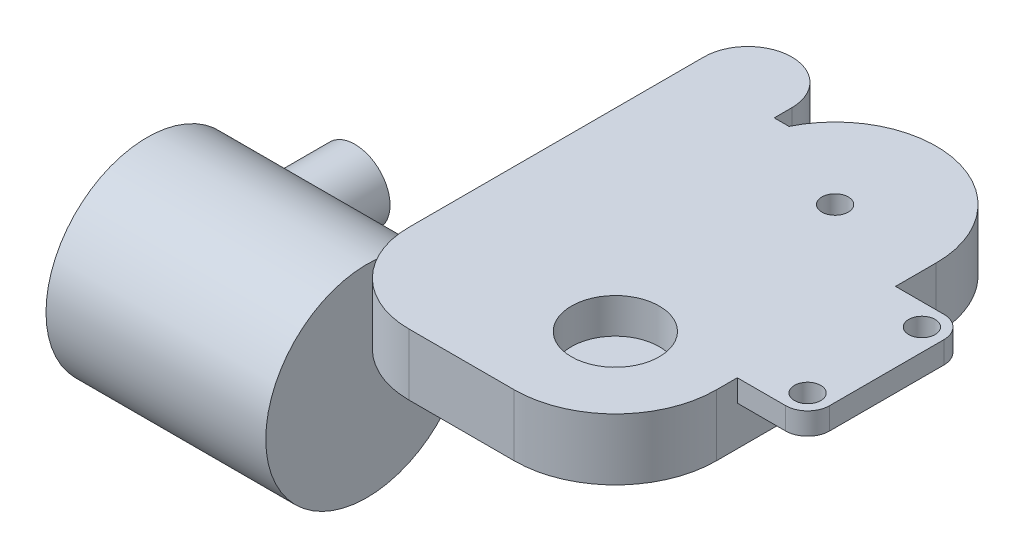
ISO-10303-21;
HEADER;
FILE_DESCRIPTION(('STEP AP214'),'2;1');
FILE_NAME('part.step','',(''),(''),'','','');
FILE_SCHEMA(('AUTOMOTIVE_DESIGN { 1 0 10303 214 1 1 1 1 }'));
ENDSEC;
DATA;
#1=APPLICATION_CONTEXT('core data for automotive mechanical design processes');
#2=APPLICATION_PROTOCOL_DEFINITION('international standard','automotive_design',2000,#1);
#3=PRODUCT_CONTEXT('',#1,'mechanical');
#4=PRODUCT('Part','Part','',(#3));
#5=PRODUCT_RELATED_PRODUCT_CATEGORY('part','',(#4));
#6=PRODUCT_DEFINITION_FORMATION('','',#4);
#7=PRODUCT_DEFINITION_CONTEXT('part definition',#1,'design');
#8=PRODUCT_DEFINITION('design','',#6,#7);
#9=PRODUCT_DEFINITION_SHAPE('','',#8);
#10=(LENGTH_UNIT() NAMED_UNIT(*) SI_UNIT(.MILLI.,.METRE.));
#11=(NAMED_UNIT(*) PLANE_ANGLE_UNIT() SI_UNIT($,.RADIAN.));
#12=(NAMED_UNIT(*) SI_UNIT($,.STERADIAN.) SOLID_ANGLE_UNIT());
#13=UNCERTAINTY_MEASURE_WITH_UNIT(LENGTH_MEASURE(1.E-05),#10,'distance_accuracy_value','');
#14=(GEOMETRIC_REPRESENTATION_CONTEXT(3) GLOBAL_UNCERTAINTY_ASSIGNED_CONTEXT((#13)) GLOBAL_UNIT_ASSIGNED_CONTEXT((#10,
#11,#12)) REPRESENTATION_CONTEXT('',''));
#15=CARTESIAN_POINT('',(0.,0.,0.));
#16=DIRECTION('',(0.,0.,1.));
#17=DIRECTION('',(1.,0.,0.));
#18=AXIS2_PLACEMENT_3D('',#15,#16,#17);
#19=CARTESIAN_POINT('',(17.,7.,22.8719406132536));
#20=DIRECTION('',(0.,0.,1.));
#21=DIRECTION('',(1.,0.,0.));
#22=AXIS2_PLACEMENT_3D('',#19,#20,#21);
#23=PLANE('',#22);
#24=DIRECTION('',(-1.,0.,0.));
#25=VECTOR('',#24,1.);
#26=CARTESIAN_POINT('',(17.,0.,22.8719406132536));
#27=LINE('',#26,#25);
#28=CARTESIAN_POINT('',(17.,0.,22.8719406132536));
#29=VERTEX_POINT('',#28);
#30=CARTESIAN_POINT('',(4.99999999999999,0.,22.8719406132536));
#31=VERTEX_POINT('',#30);
#32=EDGE_CURVE('E232',#29,#31,#27,.T.);
#33=ORIENTED_EDGE('',*,*,#32,.F.);
#34=DIRECTION('',(0.,-1.,0.));
#35=VECTOR('',#34,1.);
#36=CARTESIAN_POINT('',(17.,7.,22.8719406132536));
#37=LINE('',#36,#35);
#38=CARTESIAN_POINT('',(17.,7.,22.8719406132536));
#39=VERTEX_POINT('',#38);
#40=EDGE_CURVE('E11',#39,#29,#37,.T.);
#41=ORIENTED_EDGE('',*,*,#40,.F.);
#42=DIRECTION('',(-1.,0.,0.));
#43=VECTOR('',#42,1.);
#44=CARTESIAN_POINT('',(17.,7.,22.8719406132536));
#45=LINE('',#44,#43);
#46=CARTESIAN_POINT('',(4.99999999999999,7.,22.8719406132536));
#47=VERTEX_POINT('',#46);
#48=EDGE_CURVE('E235',#39,#47,#45,.T.);
#49=ORIENTED_EDGE('',*,*,#48,.T.);
#50=DIRECTION('',(0.,-1.,0.));
#51=VECTOR('',#50,1.);
#52=CARTESIAN_POINT('',(4.99999999999999,7.,22.8719406132536));
#53=LINE('',#52,#51);
#54=EDGE_CURVE('E259',#47,#31,#53,.T.);
#55=ORIENTED_EDGE('',*,*,#54,.T.);
#56=EDGE_LOOP('',(#33,#41,#49,#55));
#57=FACE_BOUND('',#56,.T.);
#58=ADVANCED_FACE('F32',(#57),#23,.T.);
#59=CARTESIAN_POINT('',(17.,7.,11.3719406132536));
#60=DIRECTION('',(0.,-1.,0.));
#61=DIRECTION('',(0.,0.,-1.));
#62=AXIS2_PLACEMENT_3D('',#59,#60,#61);
#63=CYLINDRICAL_SURFACE('',#62,11.5);
#64=CARTESIAN_POINT('',(17.,0.,11.3719406132536));
#65=DIRECTION('',(0.,1.,0.));
#66=DIRECTION('',(0.,0.,1.));
#67=AXIS2_PLACEMENT_3D('',#64,#65,#66);
#68=CIRCLE('',#67,11.5);
#69=CARTESIAN_POINT('',(28.5,0.,11.3719406132536));
#70=VERTEX_POINT('',#69);
#71=EDGE_CURVE('E239',#29,#70,#68,.T.);
#72=ORIENTED_EDGE('',*,*,#71,.T.);
#73=DIRECTION('',(0.,-1.,0.));
#74=VECTOR('',#73,1.);
#75=CARTESIAN_POINT('',(28.5,7.,11.3719406132536));
#76=LINE('',#75,#74);
#77=CARTESIAN_POINT('',(28.5,7.,11.3719406132536));
#78=VERTEX_POINT('',#77);
#79=EDGE_CURVE('E45',#78,#70,#76,.T.);
#80=ORIENTED_EDGE('',*,*,#79,.F.);
#81=CARTESIAN_POINT('',(17.,7.,11.3719406132536));
#82=DIRECTION('',(0.,1.,0.));
#83=DIRECTION('',(0.,0.,1.));
#84=AXIS2_PLACEMENT_3D('',#81,#82,#83);
#85=CIRCLE('',#84,11.5);
#86=EDGE_CURVE('E256',#39,#78,#85,.T.);
#87=ORIENTED_EDGE('',*,*,#86,.F.);
#88=ORIENTED_EDGE('',*,*,#40,.T.);
#89=EDGE_LOOP('',(#72,#80,#87,#88));
#90=FACE_BOUND('',#89,.T.);
#91=ADVANCED_FACE('F315',(#90),#63,.T.);
#92=CARTESIAN_POINT('',(28.5,7.,-13.6280593867464));
#93=DIRECTION('',(1.,0.,0.));
#94=DIRECTION('',(0.,0.,-1.));
#95=AXIS2_PLACEMENT_3D('',#92,#93,#94);
#96=PLANE('',#95);
#97=DIRECTION('',(0.,1.,0.));
#98=VECTOR('',#97,1.);
#99=CARTESIAN_POINT('',(28.5,4.5,-9.));
#100=LINE('',#99,#98);
#101=CARTESIAN_POINT('',(28.5,4.5,-9.00000000000001));
#102=VERTEX_POINT('',#101);
#103=CARTESIAN_POINT('',(28.5,7.,-9.));
#104=VERTEX_POINT('',#103);
#105=EDGE_CURVE('E53',#102,#104,#100,.T.);
#106=ORIENTED_EDGE('',*,*,#105,.F.);
#107=DIRECTION('',(0.,0.,1.));
#108=VECTOR('',#107,1.);
#109=CARTESIAN_POINT('',(28.5,4.5,-9.));
#110=LINE('',#109,#108);
#111=CARTESIAN_POINT('',(28.5,4.5,9.));
#112=VERTEX_POINT('',#111);
#113=EDGE_CURVE('E57',#102,#112,#110,.T.);
#114=ORIENTED_EDGE('',*,*,#113,.T.);
#115=DIRECTION('',(0.,1.,0.));
#116=VECTOR('',#115,1.);
#117=CARTESIAN_POINT('',(28.5,4.5,9.));
#118=LINE('',#117,#116);
#119=CARTESIAN_POINT('',(28.5,7.,9.));
#120=VERTEX_POINT('',#119);
#121=EDGE_CURVE('E160',#112,#120,#118,.T.);
#122=ORIENTED_EDGE('',*,*,#121,.T.);
#123=DIRECTION('',(0.,0.,1.));
#124=VECTOR('',#123,1.);
#125=CARTESIAN_POINT('',(28.5,7.,-13.6280593867464));
#126=LINE('',#125,#124);
#127=EDGE_CURVE('E253',#120,#78,#126,.T.);
#128=ORIENTED_EDGE('',*,*,#127,.T.);
#129=ORIENTED_EDGE('',*,*,#79,.T.);
#130=DIRECTION('',(0.,0.,1.));
#131=VECTOR('',#130,1.);
#132=CARTESIAN_POINT('',(28.5,0.,-13.6280593867464));
#133=LINE('',#132,#131);
#134=CARTESIAN_POINT('',(28.5,0.,-13.6280593867464));
#135=VERTEX_POINT('',#134);
#136=EDGE_CURVE('E280',#135,#70,#133,.T.);
#137=ORIENTED_EDGE('',*,*,#136,.F.);
#138=DIRECTION('',(0.,-1.,0.));
#139=VECTOR('',#138,1.);
#140=CARTESIAN_POINT('',(28.5,7.,-13.6280593867464));
#141=LINE('',#140,#139);
#142=CARTESIAN_POINT('',(28.5,7.,-13.6280593867464));
#143=VERTEX_POINT('',#142);
#144=EDGE_CURVE('E286',#143,#135,#141,.T.);
#145=ORIENTED_EDGE('',*,*,#144,.F.);
#146=EDGE_CURVE('E254',#143,#104,#126,.T.);
#147=ORIENTED_EDGE('',*,*,#146,.T.);
#148=EDGE_LOOP('',(#106,#114,#122,#128,#129,#137,#145,#147));
#149=FACE_BOUND('',#148,.T.);
#150=ADVANCED_FACE('F353',(#149),#96,.T.);
#151=CARTESIAN_POINT('',(17.,7.,-13.6280593867464));
#152=DIRECTION('',(0.,-1.,0.));
#153=DIRECTION('',(0.,0.,-1.));
#154=AXIS2_PLACEMENT_3D('',#151,#152,#153);
#155=CYLINDRICAL_SURFACE('',#154,11.5);
#156=CARTESIAN_POINT('',(17.,0.,-13.6280593867464));
#157=DIRECTION('',(0.,1.,0.));
#158=DIRECTION('',(0.,0.,1.));
#159=AXIS2_PLACEMENT_3D('',#156,#157,#158);
#160=CIRCLE('',#159,11.5);
#161=CARTESIAN_POINT('',(6.67950259000501,0.,-18.7012569198892));
#162=VERTEX_POINT('',#161);
#163=EDGE_CURVE('E277',#135,#162,#160,.T.);
#164=ORIENTED_EDGE('',*,*,#163,.T.);
#165=DIRECTION('',(0.,-1.,0.));
#166=VECTOR('',#165,1.);
#167=CARTESIAN_POINT('',(6.67950259000501,7.,-18.7012569198892));
#168=LINE('',#167,#166);
#169=CARTESIAN_POINT('',(6.67950259000501,7.,-18.7012569198892));
#170=VERTEX_POINT('',#169);
#171=EDGE_CURVE('E288',#170,#162,#168,.T.);
#172=ORIENTED_EDGE('',*,*,#171,.F.);
#173=CARTESIAN_POINT('',(17.,7.,-13.6280593867464));
#174=DIRECTION('',(0.,1.,0.));
#175=DIRECTION('',(0.,0.,1.));
#176=AXIS2_PLACEMENT_3D('',#173,#174,#175);
#177=CIRCLE('',#176,11.5);
#178=EDGE_CURVE('E251',#143,#170,#177,.T.);
#179=ORIENTED_EDGE('',*,*,#178,.F.);
#180=ORIENTED_EDGE('',*,*,#144,.T.);
#181=EDGE_LOOP('',(#164,#172,#179,#180));
#182=FACE_BOUND('',#181,.T.);
#183=ADVANCED_FACE('F358',(#182),#155,.T.);
#184=CARTESIAN_POINT('',(5.,7.,-18.7012569198892));
#185=DIRECTION('',(0.,0.,-1.));
#186=DIRECTION('',(-1.,0.,0.));
#187=AXIS2_PLACEMENT_3D('',#184,#185,#186);
#188=PLANE('',#187);
#189=DIRECTION('',(1.,0.,0.));
#190=VECTOR('',#189,1.);
#191=CARTESIAN_POINT('',(5.,0.,-18.7012569198892));
#192=LINE('',#191,#190);
#193=CARTESIAN_POINT('',(5.,0.,-18.7012569198892));
#194=VERTEX_POINT('',#193);
#195=EDGE_CURVE('E274',#194,#162,#192,.T.);
#196=ORIENTED_EDGE('',*,*,#195,.F.);
#197=DIRECTION('',(0.,-1.,0.));
#198=VECTOR('',#197,1.);
#199=CARTESIAN_POINT('',(5.,7.,-18.7012569198892));
#200=LINE('',#199,#198);
#201=CARTESIAN_POINT('',(5.,7.,-18.7012569198892));
#202=VERTEX_POINT('',#201);
#203=EDGE_CURVE('E290',#202,#194,#200,.T.);
#204=ORIENTED_EDGE('',*,*,#203,.F.);
#205=DIRECTION('',(1.,0.,0.));
#206=VECTOR('',#205,1.);
#207=CARTESIAN_POINT('',(5.,7.,-18.7012569198892));
#208=LINE('',#207,#206);
#209=EDGE_CURVE('E248',#202,#170,#208,.T.);
#210=ORIENTED_EDGE('',*,*,#209,.T.);
#211=ORIENTED_EDGE('',*,*,#171,.T.);
#212=EDGE_LOOP('',(#196,#204,#210,#211));
#213=FACE_BOUND('',#212,.T.);
#214=ADVANCED_FACE('F365',(#213),#188,.T.);
#215=CARTESIAN_POINT('',(5.,7.,-20.7012569198892));
#216=DIRECTION('',(1.,0.,0.));
#217=DIRECTION('',(0.,0.,-1.));
#218=AXIS2_PLACEMENT_3D('',#215,#216,#217);
#219=PLANE('',#218);
#220=DIRECTION('',(0.,0.,1.));
#221=VECTOR('',#220,1.);
#222=CARTESIAN_POINT('',(5.,0.,-20.7012569198892));
#223=LINE('',#222,#221);
#224=CARTESIAN_POINT('',(5.,0.,-20.7012569198892));
#225=VERTEX_POINT('',#224);
#226=EDGE_CURVE('E271',#225,#194,#223,.T.);
#227=ORIENTED_EDGE('',*,*,#226,.F.);
#228=DIRECTION('',(0.,-1.,0.));
#229=VECTOR('',#228,1.);
#230=CARTESIAN_POINT('',(5.,7.,-20.7012569198892));
#231=LINE('',#230,#229);
#232=CARTESIAN_POINT('',(5.,7.,-20.7012569198892));
#233=VERTEX_POINT('',#232);
#234=EDGE_CURVE('E292',#233,#225,#231,.T.);
#235=ORIENTED_EDGE('',*,*,#234,.F.);
#236=DIRECTION('',(0.,0.,1.));
#237=VECTOR('',#236,1.);
#238=CARTESIAN_POINT('',(5.,7.,-20.7012569198892));
#239=LINE('',#238,#237);
#240=EDGE_CURVE('E245',#233,#202,#239,.T.);
#241=ORIENTED_EDGE('',*,*,#240,.T.);
#242=ORIENTED_EDGE('',*,*,#203,.T.);
#243=EDGE_LOOP('',(#227,#235,#241,#242));
#244=FACE_BOUND('',#243,.T.);
#245=ADVANCED_FACE('F369',(#244),#219,.T.);
#246=CARTESIAN_POINT('',(0.,7.,-20.7012569198892));
#247=DIRECTION('',(0.,-1.,0.));
#248=DIRECTION('',(0.,0.,-1.));
#249=AXIS2_PLACEMENT_3D('',#246,#247,#248);
#250=CYLINDRICAL_SURFACE('',#249,5.);
#251=CARTESIAN_POINT('',(0.,0.,-20.7012569198892));
#252=DIRECTION('',(0.,1.,0.));
#253=DIRECTION('',(0.,0.,1.));
#254=AXIS2_PLACEMENT_3D('',#251,#252,#253);
#255=CIRCLE('',#254,5.);
#256=CARTESIAN_POINT('',(-5.,0.,-20.7012569198892));
#257=VERTEX_POINT('',#256);
#258=EDGE_CURVE('E269',#225,#257,#255,.T.);
#259=ORIENTED_EDGE('',*,*,#258,.T.);
#260=DIRECTION('',(0.,-1.,0.));
#261=VECTOR('',#260,1.);
#262=CARTESIAN_POINT('',(-5.,7.,-20.7012569198892));
#263=LINE('',#262,#261);
#264=CARTESIAN_POINT('',(-5.,7.,-20.7012569198892));
#265=VERTEX_POINT('',#264);
#266=EDGE_CURVE('E294',#265,#257,#263,.T.);
#267=ORIENTED_EDGE('',*,*,#266,.F.);
#268=CARTESIAN_POINT('',(0.,7.,-20.7012569198892));
#269=DIRECTION('',(0.,1.,0.));
#270=DIRECTION('',(0.,0.,1.));
#271=AXIS2_PLACEMENT_3D('',#268,#269,#270);
#272=CIRCLE('',#271,5.);
#273=EDGE_CURVE('E243',#233,#265,#272,.T.);
#274=ORIENTED_EDGE('',*,*,#273,.F.);
#275=ORIENTED_EDGE('',*,*,#234,.T.);
#276=EDGE_LOOP('',(#259,#267,#274,#275));
#277=FACE_BOUND('',#276,.T.);
#278=ADVANCED_FACE('F373',(#277),#250,.T.);
#279=CARTESIAN_POINT('',(-5.,7.,-20.7012569198892));
#280=DIRECTION('',(1.,0.,0.));
#281=DIRECTION('',(0.,0.,-1.));
#282=AXIS2_PLACEMENT_3D('',#279,#280,#281);
#283=PLANE('',#282);
#284=CARTESIAN_POINT('',(-5.,-5.75,17.6377707257984));
#285=DIRECTION('',(-1.,0.,0.));
#286=DIRECTION('',(0.,0.,1.));
#287=AXIS2_PLACEMENT_3D('',#284,#285,#286);
#288=CIRCLE('',#287,11.5);
#289=CARTESIAN_POINT('',(-5.,4.71598601844858,12.8719406132535));
#290=VERTEX_POINT('',#289);
#291=CARTESIAN_POINT('',(-5.,0.,7.67847858227737));
#292=VERTEX_POINT('',#291);
#293=EDGE_CURVE('E210',#290,#292,#288,.T.);
#294=ORIENTED_EDGE('',*,*,#293,.F.);
#295=DIRECTION('',(0.,-1.,0.));
#296=VECTOR('',#295,1.);
#297=CARTESIAN_POINT('',(-5.,7.,12.8719406132535));
#298=LINE('',#297,#296);
#299=CARTESIAN_POINT('',(-5.,7.,12.8719406132535));
#300=VERTEX_POINT('',#299);
#301=EDGE_CURVE('E297',#300,#290,#298,.T.);
#302=ORIENTED_EDGE('',*,*,#301,.F.);
#303=DIRECTION('',(0.,0.,1.));
#304=VECTOR('',#303,1.);
#305=CARTESIAN_POINT('',(-5.,7.,-20.7012569198892));
#306=LINE('',#305,#304);
#307=EDGE_CURVE('E241',#265,#300,#306,.T.);
#308=ORIENTED_EDGE('',*,*,#307,.F.);
#309=ORIENTED_EDGE('',*,*,#266,.T.);
#310=DIRECTION('',(0.,0.,1.));
#311=VECTOR('',#310,1.);
#312=CARTESIAN_POINT('',(-5.,0.,-20.7012569198892));
#313=LINE('',#312,#311);
#314=EDGE_CURVE('E266',#257,#292,#313,.T.);
#315=ORIENTED_EDGE('',*,*,#314,.T.);
#316=EDGE_LOOP('',(#294,#302,#308,#309,#315));
#317=FACE_BOUND('',#316,.T.);
#318=ADVANCED_FACE('F377',(#317),#283,.F.);
#319=CARTESIAN_POINT('',(4.99999999999999,7.,12.8719406132536));
#320=DIRECTION('',(0.,-1.,0.));
#321=DIRECTION('',(0.,0.,-1.));
#322=AXIS2_PLACEMENT_3D('',#319,#320,#321);
#323=CYLINDRICAL_SURFACE('',#322,10.);
#324=CARTESIAN_POINT('',(4.99999999999999,0.,12.8719406132536));
#325=DIRECTION('',(0.,1.,0.));
#326=DIRECTION('',(0.,0.,1.));
#327=AXIS2_PLACEMENT_3D('',#324,#325,#326);
#328=CIRCLE('',#327,10.);
#329=CARTESIAN_POINT('',(-5.,0.,12.8719406132536));
#330=VERTEX_POINT('',#329);
#331=EDGE_CURVE('E262',#330,#31,#328,.T.);
#332=ORIENTED_EDGE('',*,*,#331,.T.);
#333=ORIENTED_EDGE('',*,*,#54,.F.);
#334=CARTESIAN_POINT('',(4.99999999999999,7.,12.8719406132536));
#335=DIRECTION('',(0.,1.,0.));
#336=DIRECTION('',(0.,0.,1.));
#337=AXIS2_PLACEMENT_3D('',#334,#335,#336);
#338=CIRCLE('',#337,10.);
#339=EDGE_CURVE('E238',#300,#47,#338,.T.);
#340=ORIENTED_EDGE('',*,*,#339,.F.);
#341=ORIENTED_EDGE('',*,*,#301,.T.);
#342=DIRECTION('',(0.,-1.,0.));
#343=VECTOR('',#342,1.);
#344=CARTESIAN_POINT('',(-5.,7.,12.8719406132536));
#345=LINE('',#344,#343);
#346=EDGE_CURVE('E209',#290,#330,#345,.T.);
#347=ORIENTED_EDGE('',*,*,#346,.T.);
#348=EDGE_LOOP('',(#332,#333,#340,#341,#347));
#349=FACE_BOUND('',#348,.T.);
#350=ADVANCED_FACE('F305',(#349),#323,.T.);
#351=CARTESIAN_POINT('',(4.99999999999999,7.,12.8719406132536));
#352=DIRECTION('',(0.,1.,0.));
#353=DIRECTION('',(0.,0.,1.));
#354=AXIS2_PLACEMENT_3D('',#351,#352,#353);
#355=PLANE('',#354);
#356=CARTESIAN_POINT('',(17.,7.,-13.6280593867464));
#357=DIRECTION('',(0.,1.,0.));
#358=DIRECTION('',(0.,0.,1.));
#359=AXIS2_PLACEMENT_3D('',#356,#357,#358);
#360=CIRCLE('',#359,1.5);
#361=CARTESIAN_POINT('',(17.,7.,-12.1280593867464));
#362=VERTEX_POINT('',#361);
#363=EDGE_CURVE('E221',#362,#362,#360,.T.);
#364=ORIENTED_EDGE('',*,*,#363,.F.);
#365=EDGE_LOOP('',(#364));
#366=FACE_BOUND('',#365,.T.);
#367=CARTESIAN_POINT('',(17.,7.,11.3719406132536));
#368=DIRECTION('',(0.,1.,0.));
#369=DIRECTION('',(0.,0.,1.));
#370=AXIS2_PLACEMENT_3D('',#367,#368,#369);
#371=CIRCLE('',#370,5.);
#372=CARTESIAN_POINT('',(17.,7.,16.3719406132536));
#373=VERTEX_POINT('',#372);
#374=EDGE_CURVE('E216',#373,#373,#371,.T.);
#375=ORIENTED_EDGE('',*,*,#374,.F.);
#376=EDGE_LOOP('',(#375));
#377=FACE_BOUND('',#376,.T.);
#378=ORIENTED_EDGE('',*,*,#48,.F.);
#379=ORIENTED_EDGE('',*,*,#86,.T.);
#380=ORIENTED_EDGE('',*,*,#127,.F.);
#381=DIRECTION('',(1.,0.,0.));
#382=VECTOR('',#381,1.);
#383=CARTESIAN_POINT('',(28.5,7.,9.));
#384=LINE('',#383,#382);
#385=CARTESIAN_POINT('',(34.,7.,9.));
#386=VERTEX_POINT('',#385);
#387=EDGE_CURVE('E184',#120,#386,#384,.T.);
#388=ORIENTED_EDGE('',*,*,#387,.T.);
#389=CARTESIAN_POINT('',(34.,7.,6.5));
#390=DIRECTION('',(0.,1.,0.));
#391=DIRECTION('',(0.,0.,-1.));
#392=AXIS2_PLACEMENT_3D('',#389,#390,#391);
#393=CIRCLE('',#392,2.5);
#394=CARTESIAN_POINT('',(36.5,7.,6.5));
#395=VERTEX_POINT('',#394);
#396=EDGE_CURVE('E154',#386,#395,#393,.T.);
#397=ORIENTED_EDGE('',*,*,#396,.T.);
#398=DIRECTION('',(0.,0.,-1.));
#399=VECTOR('',#398,1.);
#400=CARTESIAN_POINT('',(36.5,7.,-6.5));
#401=LINE('',#400,#399);
#402=CARTESIAN_POINT('',(36.5,7.,-6.5));
#403=VERTEX_POINT('',#402);
#404=EDGE_CURVE('E188',#395,#403,#401,.T.);
#405=ORIENTED_EDGE('',*,*,#404,.T.);
#406=CARTESIAN_POINT('',(34.,7.,-6.5));
#407=DIRECTION('',(0.,1.,0.));
#408=DIRECTION('',(0.,0.,1.));
#409=AXIS2_PLACEMENT_3D('',#406,#407,#408);
#410=CIRCLE('',#409,2.5);
#411=CARTESIAN_POINT('',(34.,7.,-9.));
#412=VERTEX_POINT('',#411);
#413=EDGE_CURVE('E191',#403,#412,#410,.T.);
#414=ORIENTED_EDGE('',*,*,#413,.T.);
#415=DIRECTION('',(-1.,0.,0.));
#416=VECTOR('',#415,1.);
#417=CARTESIAN_POINT('',(28.5,7.,-9.));
#418=LINE('',#417,#416);
#419=EDGE_CURVE('E173',#412,#104,#418,.T.);
#420=ORIENTED_EDGE('',*,*,#419,.T.);
#421=ORIENTED_EDGE('',*,*,#146,.F.);
#422=ORIENTED_EDGE('',*,*,#178,.T.);
#423=ORIENTED_EDGE('',*,*,#209,.F.);
#424=ORIENTED_EDGE('',*,*,#240,.F.);
#425=ORIENTED_EDGE('',*,*,#273,.T.);
#426=ORIENTED_EDGE('',*,*,#307,.T.);
#427=ORIENTED_EDGE('',*,*,#339,.T.);
#428=EDGE_LOOP('',(#378,#379,#380,#388,#397,#405,#414,#420,#421,#422,#423,#424,#425,#426,#427));
#429=FACE_BOUND('',#428,.T.);
#430=CARTESIAN_POINT('',(34.,7.,-6.5));
#431=DIRECTION('',(0.,1.,0.));
#432=DIRECTION('',(0.,0.,1.));
#433=AXIS2_PLACEMENT_3D('',#430,#431,#432);
#434=CIRCLE('',#433,1.5);
#435=CARTESIAN_POINT('',(34.,7.,-5.));
#436=VERTEX_POINT('',#435);
#437=EDGE_CURVE('E541',#436,#436,#434,.T.);
#438=ORIENTED_EDGE('',*,*,#437,.F.);
#439=EDGE_LOOP('',(#438));
#440=FACE_BOUND('',#439,.T.);
#441=CARTESIAN_POINT('',(34.,7.,6.5));
#442=DIRECTION('',(0.,1.,0.));
#443=DIRECTION('',(0.,0.,1.));
#444=AXIS2_PLACEMENT_3D('',#441,#442,#443);
#445=CIRCLE('',#444,1.5);
#446=CARTESIAN_POINT('',(34.,7.,8.));
#447=VERTEX_POINT('',#446);
#448=EDGE_CURVE('E543',#447,#447,#445,.T.);
#449=ORIENTED_EDGE('',*,*,#448,.F.);
#450=EDGE_LOOP('',(#449));
#451=FACE_BOUND('',#450,.T.);
#452=ADVANCED_FACE('F318',(#366,#377,#429,#440,#451),#355,.T.);
#453=CARTESIAN_POINT('',(4.99999999999999,0.,12.8719406132536));
#454=DIRECTION('',(0.,1.,0.));
#455=DIRECTION('',(0.,0.,1.));
#456=AXIS2_PLACEMENT_3D('',#453,#454,#455);
#457=PLANE('',#456);
#458=CARTESIAN_POINT('',(0.,0.,-20.7012569198892));
#459=DIRECTION('',(0.,-1.,0.));
#460=DIRECTION('',(0.,0.,-1.));
#461=AXIS2_PLACEMENT_3D('',#458,#459,#460);
#462=CIRCLE('',#461,2.5);
#463=CARTESIAN_POINT('',(0.,0.,-23.2012569198892));
#464=VERTEX_POINT('',#463);
#465=EDGE_CURVE('E220',#464,#464,#462,.T.);
#466=ORIENTED_EDGE('',*,*,#465,.F.);
#467=EDGE_LOOP('',(#466));
#468=FACE_BOUND('',#467,.T.);
#469=ORIENTED_EDGE('',*,*,#32,.T.);
#470=ORIENTED_EDGE('',*,*,#331,.F.);
#471=EDGE_CURVE('E265',#292,#330,#313,.T.);
#472=ORIENTED_EDGE('',*,*,#471,.F.);
#473=ORIENTED_EDGE('',*,*,#314,.F.);
#474=ORIENTED_EDGE('',*,*,#258,.F.);
#475=ORIENTED_EDGE('',*,*,#226,.T.);
#476=ORIENTED_EDGE('',*,*,#195,.T.);
#477=ORIENTED_EDGE('',*,*,#163,.F.);
#478=ORIENTED_EDGE('',*,*,#136,.T.);
#479=ORIENTED_EDGE('',*,*,#71,.F.);
#480=EDGE_LOOP('',(#469,#470,#472,#473,#474,#475,#476,#477,#478,#479));
#481=FACE_BOUND('',#480,.T.);
#482=ADVANCED_FACE('F310',(#468,#481),#457,.F.);
#483=CARTESIAN_POINT('',(0.,4.,-20.7012569198892));
#484=DIRECTION('',(0.,-1.,0.));
#485=DIRECTION('',(0.,0.,-1.));
#486=AXIS2_PLACEMENT_3D('',#483,#484,#485);
#487=CYLINDRICAL_SURFACE('',#486,2.5);
#488=CARTESIAN_POINT('',(0.,4.,-20.7012569198892));
#489=DIRECTION('',(0.,-1.,0.));
#490=DIRECTION('',(0.,0.,-1.));
#491=AXIS2_PLACEMENT_3D('',#488,#489,#490);
#492=CIRCLE('',#491,2.5);
#493=CARTESIAN_POINT('',(0.,4.,-23.2012569198892));
#494=VERTEX_POINT('',#493);
#495=EDGE_CURVE('E229',#494,#494,#492,.T.);
#496=ORIENTED_EDGE('',*,*,#495,.F.);
#497=EDGE_LOOP('',(#496));
#498=FACE_BOUND('',#497,.T.);
#499=ORIENTED_EDGE('',*,*,#465,.T.);
#500=EDGE_LOOP('',(#499));
#501=FACE_BOUND('',#500,.T.);
#502=ADVANCED_FACE('F388',(#498,#501),#487,.F.);
#503=CARTESIAN_POINT('',(0.,4.,-20.7012569198892));
#504=DIRECTION('',(0.,-1.,0.));
#505=DIRECTION('',(0.,0.,-1.));
#506=AXIS2_PLACEMENT_3D('',#503,#504,#505);
#507=PLANE('',#506);
#508=ORIENTED_EDGE('',*,*,#495,.T.);
#509=EDGE_LOOP('',(#508));
#510=FACE_BOUND('',#509,.T.);
#511=ADVANCED_FACE('F395',(#510),#507,.T.);
#512=CARTESIAN_POINT('',(17.,3.,11.3719406132536));
#513=DIRECTION('',(0.,1.,0.));
#514=DIRECTION('',(0.,0.,1.));
#515=AXIS2_PLACEMENT_3D('',#512,#513,#514);
#516=CYLINDRICAL_SURFACE('',#515,5.);
#517=CARTESIAN_POINT('',(17.,3.,11.3719406132536));
#518=DIRECTION('',(0.,1.,0.));
#519=DIRECTION('',(0.,0.,1.));
#520=AXIS2_PLACEMENT_3D('',#517,#518,#519);
#521=CIRCLE('',#520,5.);
#522=CARTESIAN_POINT('',(17.,3.,16.3719406132536));
#523=VERTEX_POINT('',#522);
#524=EDGE_CURVE('E224',#523,#523,#521,.T.);
#525=ORIENTED_EDGE('',*,*,#524,.F.);
#526=EDGE_LOOP('',(#525));
#527=FACE_BOUND('',#526,.T.);
#528=ORIENTED_EDGE('',*,*,#374,.T.);
#529=EDGE_LOOP('',(#528));
#530=FACE_BOUND('',#529,.T.);
#531=ADVANCED_FACE('F399',(#527,#530),#516,.F.);
#532=CARTESIAN_POINT('',(17.,3.,11.3719406132536));
#533=DIRECTION('',(0.,1.,0.));
#534=DIRECTION('',(0.,0.,1.));
#535=AXIS2_PLACEMENT_3D('',#532,#533,#534);
#536=PLANE('',#535);
#537=ORIENTED_EDGE('',*,*,#524,.T.);
#538=EDGE_LOOP('',(#537));
#539=FACE_BOUND('',#538,.T.);
#540=ADVANCED_FACE('F403',(#539),#536,.T.);
#541=CARTESIAN_POINT('',(17.,3.,-13.6280593867464));
#542=DIRECTION('',(0.,1.,0.));
#543=DIRECTION('',(0.,0.,1.));
#544=AXIS2_PLACEMENT_3D('',#541,#542,#543);
#545=CYLINDRICAL_SURFACE('',#544,1.5);
#546=CARTESIAN_POINT('',(17.,3.,-13.6280593867464));
#547=DIRECTION('',(0.,1.,0.));
#548=DIRECTION('',(0.,0.,1.));
#549=AXIS2_PLACEMENT_3D('',#546,#547,#548);
#550=CIRCLE('',#549,1.5);
#551=CARTESIAN_POINT('',(17.,3.,-12.1280593867464));
#552=VERTEX_POINT('',#551);
#553=EDGE_CURVE('E217',#552,#552,#550,.T.);
#554=ORIENTED_EDGE('',*,*,#553,.F.);
#555=EDGE_LOOP('',(#554));
#556=FACE_BOUND('',#555,.T.);
#557=ORIENTED_EDGE('',*,*,#363,.T.);
#558=EDGE_LOOP('',(#557));
#559=FACE_BOUND('',#558,.T.);
#560=ADVANCED_FACE('F407',(#556,#559),#545,.F.);
#561=CARTESIAN_POINT('',(17.,3.,-13.6280593867464));
#562=DIRECTION('',(0.,1.,0.));
#563=DIRECTION('',(0.,0.,1.));
#564=AXIS2_PLACEMENT_3D('',#561,#562,#563);
#565=PLANE('',#564);
#566=ORIENTED_EDGE('',*,*,#553,.T.);
#567=EDGE_LOOP('',(#566));
#568=FACE_BOUND('',#567,.T.);
#569=ADVANCED_FACE('F411',(#568),#565,.T.);
#570=CARTESIAN_POINT('',(-30.,-5.75,17.6377707257984));
#571=DIRECTION('',(1.,0.,0.));
#572=DIRECTION('',(0.,0.,-1.));
#573=AXIS2_PLACEMENT_3D('',#570,#571,#572);
#574=CYLINDRICAL_SURFACE('',#573,11.5);
#575=CARTESIAN_POINT('',(-29.,-5.75,6.13777072579842));
#576=CARTESIAN_POINT('',(-29.0000030478945,-5.9677059567305,6.13776860625565));
#577=CARTESIAN_POINT('',(-28.982169394708,-6.18539019252409,6.14400875961502));
#578=CARTESIAN_POINT('',(-28.9115475979061,-6.61431440506052,6.16828449049325));
#579=CARTESIAN_POINT('',(-28.8587588445199,-6.82555426931791,6.18632027377972));
#580=CARTESIAN_POINT('',(-28.7202779509356,-7.23534426863129,6.23223540461053));
#581=CARTESIAN_POINT('',(-28.6346437115934,-7.43391602094574,6.26009742329825));
#582=CARTESIAN_POINT('',(-28.4331754680659,-7.81387426878713,6.32284461854798));
#583=CARTESIAN_POINT('',(-28.3173347141438,-7.99525691098903,6.35773136440906));
#584=CARTESIAN_POINT('',(-28.0542102879315,-8.34245600449278,6.43233544050632));
#585=CARTESIAN_POINT('',(-27.9060000376974,-8.50754363053876,6.47217578460579));
#586=CARTESIAN_POINT('',(-27.5843123392434,-8.81108765283425,6.55154484232795));
#587=CARTESIAN_POINT('',(-27.4108286622772,-8.94953746450105,6.59107347658949));
#588=CARTESIAN_POINT('',(-27.0367708097628,-9.20019239368908,6.66672257526733));
#589=CARTESIAN_POINT('',(-26.8355105112385,-9.3114227520257,6.70269465789727));
#590=CARTESIAN_POINT('',(-26.4156875321331,-9.49814025220032,6.76527268032028));
#591=CARTESIAN_POINT('',(-26.1971307001996,-9.57363941641362,6.79188176967953));
#592=CARTESIAN_POINT('',(-25.7572458823445,-9.68396863900576,6.83141916710104));
#593=CARTESIAN_POINT('',(-25.5363054315672,-9.72017352153587,6.84480836391646));
#594=CARTESIAN_POINT('',(-25.0911110853232,-9.75518531299569,6.85774879164132));
#595=CARTESIAN_POINT('',(-24.8668583501876,-9.75400502172295,6.85730475872164));
#596=CARTESIAN_POINT('',(-24.4334042757897,-9.71534188072944,6.84303062895665));
#597=CARTESIAN_POINT('',(-24.2240135050554,-9.67968936426278,6.82987546440231));
#598=CARTESIAN_POINT('',(-23.8143957164089,-9.57609309922952,6.79277153008281));
#599=CARTESIAN_POINT('',(-23.614169891502,-9.50814515978302,6.76882135950303));
#600=CARTESIAN_POINT('',(-23.2245525372825,-9.34075527456036,6.71237075359229));
#601=CARTESIAN_POINT('',(-23.0354051369937,-9.24079413116629,6.67973097451316));
#602=CARTESIAN_POINT('',(-22.6760063747223,-9.01257604943289,6.60963320163253));
#603=CARTESIAN_POINT('',(-22.5057608737794,-8.88431037114311,6.57217372108351));
#604=CARTESIAN_POINT('',(-22.1787627662706,-8.59447353645065,6.49404069547251));
#605=CARTESIAN_POINT('',(-22.0233381038157,-8.43141746074755,6.45330583924594));
#606=CARTESIAN_POINT('',(-21.7416761329288,-8.08106221827513,6.37507437849263));
#607=CARTESIAN_POINT('',(-21.6154421438902,-7.8937602981833,6.33757814254634));
#608=CARTESIAN_POINT('',(-21.3945470882432,-7.49722360957502,6.26947751263068));
#609=CARTESIAN_POINT('',(-21.3002706396313,-7.28775891721869,6.23895842135388));
#610=CARTESIAN_POINT('',(-21.1487151902421,-6.85462353788138,6.18887384432632));
#611=CARTESIAN_POINT('',(-21.0914221437486,-6.63095827954158,6.16930420052374));
#612=CARTESIAN_POINT('',(-21.0178792369798,-6.18699091853019,6.14402652598283));
#613=CARTESIAN_POINT('',(-20.999837159213,-5.96701976709343,6.13771368525656));
#614=CARTESIAN_POINT('',(-21.0001649785526,-5.52713114756188,6.13782850983639));
#615=CARTESIAN_POINT('',(-21.0185281034969,-5.30721367709224,6.14425380557114));
#616=CARTESIAN_POINT('',(-21.0897441272059,-4.88103920472626,6.168723243794));
#617=CARTESIAN_POINT('',(-21.1414722540768,-4.67457029089508,6.18638822946388));
#618=CARTESIAN_POINT('',(-21.2765187211592,-4.27334445323628,6.23118172724804));
#619=CARTESIAN_POINT('',(-21.3598411433368,-4.07858904655627,6.25831146216669));
#620=CARTESIAN_POINT('',(-21.5582350716871,-3.70033724463812,6.32023373160523));
#621=CARTESIAN_POINT('',(-21.6741168166181,-3.51729787854783,6.35521651067099));
#622=CARTESIAN_POINT('',(-21.933401240949,-3.17269436309808,6.4289082358766));
#623=CARTESIAN_POINT('',(-22.0768129643561,-3.01113730059922,6.4676184044307));
#624=CARTESIAN_POINT('',(-22.3954992794459,-2.70571639174462,6.54685209621081));
#625=CARTESIAN_POINT('',(-22.5720028857278,-2.56313032612492,6.58737016368367));
#626=CARTESIAN_POINT('',(-22.9472835524418,-2.30941118842168,6.6637122927977));
#627=CARTESIAN_POINT('',(-23.1460613072221,-2.19827909722867,6.69953620803329));
#628=CARTESIAN_POINT('',(-23.5607842908423,-2.01096414486375,6.76213658471833));
#629=CARTESIAN_POINT('',(-23.7767247378287,-1.93477158864464,6.78891555542148));
#630=CARTESIAN_POINT('',(-24.2195343399141,-1.82022858088872,6.82987227169758));
#631=CARTESIAN_POINT('',(-24.4463979197169,-1.78185903435838,6.84405637544558));
#632=CARTESIAN_POINT('',(-24.8909913557773,-1.74561887939047,6.85745219537272));
#633=CARTESIAN_POINT('',(-25.1085247263411,-1.74560840064033,6.85745502118819));
#634=CARTESIAN_POINT('',(-25.5403173079241,-1.78074726218768,6.84446837535366));
#635=CARTESIAN_POINT('',(-25.7545767474608,-1.81589413704531,6.83147981473589));
#636=CARTESIAN_POINT('',(-26.1688957173565,-1.91878063112937,6.79458755158835));
#637=CARTESIAN_POINT('',(-26.3691664901457,-1.9857675176087,6.77093655458458));
#638=CARTESIAN_POINT('',(-26.7557706242656,-2.14980663628275,6.71549679307407));
#639=CARTESIAN_POINT('',(-26.9421007163274,-2.24686589356879,6.6837061273921));
#640=CARTESIAN_POINT('',(-27.3049859798782,-2.47358027471851,6.61371722036379));
#641=CARTESIAN_POINT('',(-27.4806768626747,-2.60454719121379,6.57528889585743));
#642=CARTESIAN_POINT('',(-27.8082768162529,-2.89320581321072,6.49725656447934));
#643=CARTESIAN_POINT('',(-27.9601788579649,-3.05090538905882,6.45765221421505));
#644=CARTESIAN_POINT('',(-28.2426315414643,-3.39684433412026,6.37964465203339));
#645=CARTESIAN_POINT('',(-28.3719537935237,-3.58611966916091,6.34137026893302));
#646=CARTESIAN_POINT('',(-28.5968358956646,-3.98501659233553,6.27222003654075));
#647=CARTESIAN_POINT('',(-28.6924007842839,-4.19463513813515,6.24134308334895));
#648=CARTESIAN_POINT('',(-28.8452359881598,-4.6250579920386,6.19090684525749));
#649=CARTESIAN_POINT('',(-28.9030720545728,-4.84564098520679,6.17118097845941));
#650=CARTESIAN_POINT('',(-28.9804459289717,-5.2941589447324,6.14461622750255));
#651=CARTESIAN_POINT('',(-28.9999968092676,-5.52209137462687,6.13777294467238));
#652=CARTESIAN_POINT('',(-29.,-5.75,6.13777072579842));
#653=B_SPLINE_CURVE_WITH_KNOTS('',3,(#575,#576,#577,#578,#579,#580,#581,#582,#583,#584,#585,
#586,#587,#588,#589,#590,#591,#592,#593,#594,#595,#596,#597,#598,#599,#600,#601,#602,#603,#604,
#605,#606,#607,#608,#609,#610,#611,#612,#613,#614,#615,#616,#617,#618,#619,#620,#621,#622,#623,
#624,#625,#626,#627,#628,#629,#630,#631,#632,#633,#634,#635,#636,#637,#638,#639,#640,#641,#642,
#643,#644,#645,#646,#647,#648,#649,#650,#651,#652),.UNSPECIFIED.,.T.,.F.,(4,2,2,2,2,2,2,2,2,2,2,
2,2,2,2,2,2,2,2,2,2,2,2,2,2,2,2,2,2,2,2,2,2,2,2,2,2,2,4),(0.,0.65227849532696,1.3045683695602,
1.9557136165797,2.6070044888385,3.28020283936096,3.95356738411836,4.64834822423538,
5.34289512688769,6.01226905195537,6.68141380173211,7.31687616624686,7.9524210153251,
8.59884498440865,9.24546883802667,9.92906259888441,10.6127340558579,11.3043635632251,
11.9957302457691,12.6548013771936,13.313749918509,13.9515696999883,14.5894719155389,
15.2449200002087,15.9005837789538,16.5888217577354,17.277081196818,17.9651495414445,
18.6528703357326,19.3022258321025,19.9515357950482,20.5862058304511,21.221024240618,
21.8855221642438,22.5502160631656,23.2440577514686,23.9377958349337,24.6208762748927,
25.3037234393111),.UNSPECIFIED.);
#654=CARTESIAN_POINT('',(-29.,-5.75,6.13777072579842));
#655=VERTEX_POINT('',#654);
#656=EDGE_CURVE('E35',#655,#655,#653,.T.);
#657=ORIENTED_EDGE('',*,*,#656,.T.);
#658=EDGE_LOOP('',(#657));
#659=FACE_BOUND('',#658,.T.);
#660=CARTESIAN_POINT('',(-30.,-5.75,17.6377707257984));
#661=DIRECTION('',(-1.,0.,0.));
#662=DIRECTION('',(0.,0.,1.));
#663=AXIS2_PLACEMENT_3D('',#660,#661,#662);
#664=CIRCLE('',#663,11.5);
#665=CARTESIAN_POINT('',(-30.,-5.75,29.1377707257984));
#666=VERTEX_POINT('',#665);
#667=EDGE_CURVE('E206',#666,#666,#664,.T.);
#668=ORIENTED_EDGE('',*,*,#667,.F.);
#669=EDGE_LOOP('',(#668));
#670=FACE_BOUND('',#669,.T.);
#671=ORIENTED_EDGE('',*,*,#293,.T.);
#672=EDGE_CURVE('E213',#292,#290,#288,.T.);
#673=ORIENTED_EDGE('',*,*,#672,.T.);
#674=EDGE_LOOP('',(#671,#673));
#675=FACE_BOUND('',#674,.T.);
#676=ADVANCED_FACE('F328',(#659,#670,#675),#574,.T.);
#677=CARTESIAN_POINT('',(-30.,-5.75,17.6377707257984));
#678=DIRECTION('',(-1.,0.,0.));
#679=DIRECTION('',(0.,0.,1.));
#680=AXIS2_PLACEMENT_3D('',#677,#678,#679);
#681=PLANE('',#680);
#682=ORIENTED_EDGE('',*,*,#667,.T.);
#683=EDGE_LOOP('',(#682));
#684=FACE_BOUND('',#683,.T.);
#685=ADVANCED_FACE('F345',(#684),#681,.T.);
#686=CARTESIAN_POINT('',(-5.,-5.75,17.6377707257984));
#687=DIRECTION('',(-1.,0.,0.));
#688=DIRECTION('',(0.,0.,1.));
#689=AXIS2_PLACEMENT_3D('',#686,#687,#688);
#690=PLANE('',#689);
#691=ORIENTED_EDGE('',*,*,#346,.F.);
#692=ORIENTED_EDGE('',*,*,#672,.F.);
#693=ORIENTED_EDGE('',*,*,#471,.T.);
#694=EDGE_LOOP('',(#691,#692,#693));
#695=FACE_BOUND('',#694,.T.);
#696=ADVANCED_FACE('F326',(#695),#690,.F.);
#697=CARTESIAN_POINT('',(-25.,-5.75,-0.999999999999999));
#698=DIRECTION('',(0.,0.,1.));
#699=DIRECTION('',(1.,0.,0.));
#700=AXIS2_PLACEMENT_3D('',#697,#698,#699);
#701=CYLINDRICAL_SURFACE('',#700,4.);
#702=CARTESIAN_POINT('',(-25.,-5.75,-0.999999999999999));
#703=DIRECTION('',(0.,0.,1.));
#704=DIRECTION('',(1.,0.,0.));
#705=AXIS2_PLACEMENT_3D('',#702,#703,#704);
#706=CIRCLE('',#705,4.);
#707=CARTESIAN_POINT('',(-21.,-5.75,-0.999999999999999));
#708=VERTEX_POINT('',#707);
#709=EDGE_CURVE('E197',#708,#708,#706,.T.);
#710=ORIENTED_EDGE('',*,*,#709,.T.);
#711=EDGE_LOOP('',(#710));
#712=FACE_BOUND('',#711,.T.);
#713=ORIENTED_EDGE('',*,*,#656,.F.);
#714=EDGE_LOOP('',(#713));
#715=FACE_BOUND('',#714,.T.);
#716=ADVANCED_FACE('F334',(#712,#715),#701,.T.);
#717=CARTESIAN_POINT('',(-25.,-5.75,-0.999999999999999));
#718=DIRECTION('',(0.,0.,1.));
#719=DIRECTION('',(1.,0.,0.));
#720=AXIS2_PLACEMENT_3D('',#717,#718,#719);
#721=PLANE('',#720);
#722=ORIENTED_EDGE('',*,*,#709,.F.);
#723=EDGE_LOOP('',(#722));
#724=FACE_BOUND('',#723,.T.);
#725=ADVANCED_FACE('F336',(#724),#721,.F.);
#726=CARTESIAN_POINT('',(28.5,4.5,-9.));
#727=DIRECTION('',(0.,0.,-1.));
#728=DIRECTION('',(-1.,0.,0.));
#729=AXIS2_PLACEMENT_3D('',#726,#727,#728);
#730=PLANE('',#729);
#731=ORIENTED_EDGE('',*,*,#419,.F.);
#732=DIRECTION('',(0.,1.,0.));
#733=VECTOR('',#732,1.);
#734=CARTESIAN_POINT('',(34.,4.5,-9.));
#735=LINE('',#734,#733);
#736=CARTESIAN_POINT('',(34.,4.5,-9.));
#737=VERTEX_POINT('',#736);
#738=EDGE_CURVE('E198',#737,#412,#735,.T.);
#739=ORIENTED_EDGE('',*,*,#738,.F.);
#740=DIRECTION('',(-1.,0.,0.));
#741=VECTOR('',#740,1.);
#742=CARTESIAN_POINT('',(28.5,4.5,-9.));
#743=LINE('',#742,#741);
#744=EDGE_CURVE('E181',#737,#102,#743,.T.);
#745=ORIENTED_EDGE('',*,*,#744,.T.);
#746=ORIENTED_EDGE('',*,*,#105,.T.);
#747=EDGE_LOOP('',(#731,#739,#745,#746));
#748=FACE_BOUND('',#747,.T.);
#749=ADVANCED_FACE('F342',(#748),#730,.T.);
#750=CARTESIAN_POINT('',(34.,4.5,-6.5));
#751=DIRECTION('',(0.,1.,0.));
#752=DIRECTION('',(0.,0.,1.));
#753=AXIS2_PLACEMENT_3D('',#750,#751,#752);
#754=CYLINDRICAL_SURFACE('',#753,2.5);
#755=ORIENTED_EDGE('',*,*,#413,.F.);
#756=DIRECTION('',(0.,1.,0.));
#757=VECTOR('',#756,1.);
#758=CARTESIAN_POINT('',(36.5,4.5,-6.5));
#759=LINE('',#758,#757);
#760=CARTESIAN_POINT('',(36.5,4.5,-6.5));
#761=VERTEX_POINT('',#760);
#762=EDGE_CURVE('E200',#761,#403,#759,.T.);
#763=ORIENTED_EDGE('',*,*,#762,.F.);
#764=CARTESIAN_POINT('',(34.,4.5,-6.5));
#765=DIRECTION('',(0.,1.,0.));
#766=DIRECTION('',(0.,0.,1.));
#767=AXIS2_PLACEMENT_3D('',#764,#765,#766);
#768=CIRCLE('',#767,2.5);
#769=EDGE_CURVE('E178',#761,#737,#768,.T.);
#770=ORIENTED_EDGE('',*,*,#769,.T.);
#771=ORIENTED_EDGE('',*,*,#738,.T.);
#772=EDGE_LOOP('',(#755,#763,#770,#771));
#773=FACE_BOUND('',#772,.T.);
#774=ADVANCED_FACE('F466',(#773),#754,.T.);
#775=CARTESIAN_POINT('',(36.5,4.5,-6.5));
#776=DIRECTION('',(1.,0.,0.));
#777=DIRECTION('',(0.,0.,-1.));
#778=AXIS2_PLACEMENT_3D('',#775,#776,#777);
#779=PLANE('',#778);
#780=ORIENTED_EDGE('',*,*,#404,.F.);
#781=DIRECTION('',(0.,1.,0.));
#782=VECTOR('',#781,1.);
#783=CARTESIAN_POINT('',(36.5,4.5,6.5));
#784=LINE('',#783,#782);
#785=CARTESIAN_POINT('',(36.5,4.5,6.5));
#786=VERTEX_POINT('',#785);
#787=EDGE_CURVE('E159',#786,#395,#784,.T.);
#788=ORIENTED_EDGE('',*,*,#787,.F.);
#789=DIRECTION('',(0.,0.,-1.));
#790=VECTOR('',#789,1.);
#791=CARTESIAN_POINT('',(36.5,4.5,-6.5));
#792=LINE('',#791,#790);
#793=EDGE_CURVE('E169',#786,#761,#792,.T.);
#794=ORIENTED_EDGE('',*,*,#793,.T.);
#795=ORIENTED_EDGE('',*,*,#762,.T.);
#796=EDGE_LOOP('',(#780,#788,#794,#795));
#797=FACE_BOUND('',#796,.T.);
#798=ADVANCED_FACE('F476',(#797),#779,.T.);
#799=CARTESIAN_POINT('',(34.,4.5,6.5));
#800=DIRECTION('',(0.,1.,0.));
#801=DIRECTION('',(0.,0.,1.));
#802=AXIS2_PLACEMENT_3D('',#799,#800,#801);
#803=CYLINDRICAL_SURFACE('',#802,2.5);
#804=ORIENTED_EDGE('',*,*,#396,.F.);
#805=DIRECTION('',(0.,1.,0.));
#806=VECTOR('',#805,1.);
#807=CARTESIAN_POINT('',(34.,4.5,9.));
#808=LINE('',#807,#806);
#809=CARTESIAN_POINT('',(34.,4.5,9.));
#810=VERTEX_POINT('',#809);
#811=EDGE_CURVE('E149',#810,#386,#808,.T.);
#812=ORIENTED_EDGE('',*,*,#811,.F.);
#813=CARTESIAN_POINT('',(34.,4.5,6.5));
#814=DIRECTION('',(0.,1.,0.));
#815=DIRECTION('',(0.,0.,-1.));
#816=AXIS2_PLACEMENT_3D('',#813,#814,#815);
#817=CIRCLE('',#816,2.5);
#818=EDGE_CURVE('E152',#810,#786,#817,.T.);
#819=ORIENTED_EDGE('',*,*,#818,.T.);
#820=ORIENTED_EDGE('',*,*,#787,.T.);
#821=EDGE_LOOP('',(#804,#812,#819,#820));
#822=FACE_BOUND('',#821,.T.);
#823=ADVANCED_FACE('F151',(#822),#803,.T.);
#824=CARTESIAN_POINT('',(28.5,4.5,9.));
#825=DIRECTION('',(0.,0.,1.));
#826=DIRECTION('',(1.,0.,0.));
#827=AXIS2_PLACEMENT_3D('',#824,#825,#826);
#828=PLANE('',#827);
#829=ORIENTED_EDGE('',*,*,#387,.F.);
#830=ORIENTED_EDGE('',*,*,#121,.F.);
#831=DIRECTION('',(1.,0.,0.));
#832=VECTOR('',#831,1.);
#833=CARTESIAN_POINT('',(28.5,4.5,9.));
#834=LINE('',#833,#832);
#835=EDGE_CURVE('E166',#112,#810,#834,.T.);
#836=ORIENTED_EDGE('',*,*,#835,.T.);
#837=ORIENTED_EDGE('',*,*,#811,.T.);
#838=EDGE_LOOP('',(#829,#830,#836,#837));
#839=FACE_BOUND('',#838,.T.);
#840=ADVANCED_FACE('F171',(#839),#828,.T.);
#841=CARTESIAN_POINT('',(34.,4.5,6.5));
#842=DIRECTION('',(0.,-1.,0.));
#843=DIRECTION('',(0.,0.,-1.));
#844=AXIS2_PLACEMENT_3D('',#841,#842,#843);
#845=PLANE('',#844);
#846=CARTESIAN_POINT('',(34.,4.5,-6.5));
#847=DIRECTION('',(0.,1.,0.));
#848=DIRECTION('',(0.,0.,1.));
#849=AXIS2_PLACEMENT_3D('',#846,#847,#848);
#850=CIRCLE('',#849,1.5);
#851=CARTESIAN_POINT('',(34.,4.5,-5.));
#852=VERTEX_POINT('',#851);
#853=EDGE_CURVE('E538',#852,#852,#850,.T.);
#854=ORIENTED_EDGE('',*,*,#853,.T.);
#855=EDGE_LOOP('',(#854));
#856=FACE_BOUND('',#855,.T.);
#857=CARTESIAN_POINT('',(34.,4.5,6.5));
#858=DIRECTION('',(0.,1.,0.));
#859=DIRECTION('',(0.,0.,1.));
#860=AXIS2_PLACEMENT_3D('',#857,#858,#859);
#861=CIRCLE('',#860,1.5);
#862=CARTESIAN_POINT('',(34.,4.5,8.));
#863=VERTEX_POINT('',#862);
#864=EDGE_CURVE('E186',#863,#863,#861,.T.);
#865=ORIENTED_EDGE('',*,*,#864,.T.);
#866=EDGE_LOOP('',(#865));
#867=FACE_BOUND('',#866,.T.);
#868=ORIENTED_EDGE('',*,*,#113,.F.);
#869=ORIENTED_EDGE('',*,*,#744,.F.);
#870=ORIENTED_EDGE('',*,*,#769,.F.);
#871=ORIENTED_EDGE('',*,*,#793,.F.);
#872=ORIENTED_EDGE('',*,*,#818,.F.);
#873=ORIENTED_EDGE('',*,*,#835,.F.);
#874=EDGE_LOOP('',(#868,#869,#870,#871,#872,#873));
#875=FACE_BOUND('',#874,.T.);
#876=ADVANCED_FACE('F165',(#856,#867,#875),#845,.T.);
#877=CARTESIAN_POINT('',(34.,4.5,6.5));
#878=DIRECTION('',(0.,1.,0.));
#879=DIRECTION('',(0.,0.,1.));
#880=AXIS2_PLACEMENT_3D('',#877,#878,#879);
#881=CYLINDRICAL_SURFACE('',#880,1.5);
#882=ORIENTED_EDGE('',*,*,#864,.F.);
#883=EDGE_LOOP('',(#882));
#884=FACE_BOUND('',#883,.T.);
#885=ORIENTED_EDGE('',*,*,#448,.T.);
#886=EDGE_LOOP('',(#885));
#887=FACE_BOUND('',#886,.T.);
#888=ADVANCED_FACE('F511',(#884,#887),#881,.F.);
#889=CARTESIAN_POINT('',(34.,4.5,-6.5));
#890=DIRECTION('',(0.,1.,0.));
#891=DIRECTION('',(0.,0.,1.));
#892=AXIS2_PLACEMENT_3D('',#889,#890,#891);
#893=CYLINDRICAL_SURFACE('',#892,1.5);
#894=ORIENTED_EDGE('',*,*,#853,.F.);
#895=EDGE_LOOP('',(#894));
#896=FACE_BOUND('',#895,.T.);
#897=ORIENTED_EDGE('',*,*,#437,.T.);
#898=EDGE_LOOP('',(#897));
#899=FACE_BOUND('',#898,.T.);
#900=ADVANCED_FACE('F521',(#896,#899),#893,.F.);
#901=CLOSED_SHELL('',(#58,#91,#150,#183,#214,#245,#278,#318,#350,#452,#482,#502,#511,#531,#540,
#560,#569,#676,#685,#696,#716,#725,#749,#774,#798,#823,#840,#876,#888,#900));
#902=MANIFOLD_SOLID_BREP('B2',#901);
#903=ADVANCED_BREP_SHAPE_REPRESENTATION('',(#18,#902),#14);
#904=SHAPE_DEFINITION_REPRESENTATION(#9,#903);
ENDSEC;
END-ISO-10303-21;
